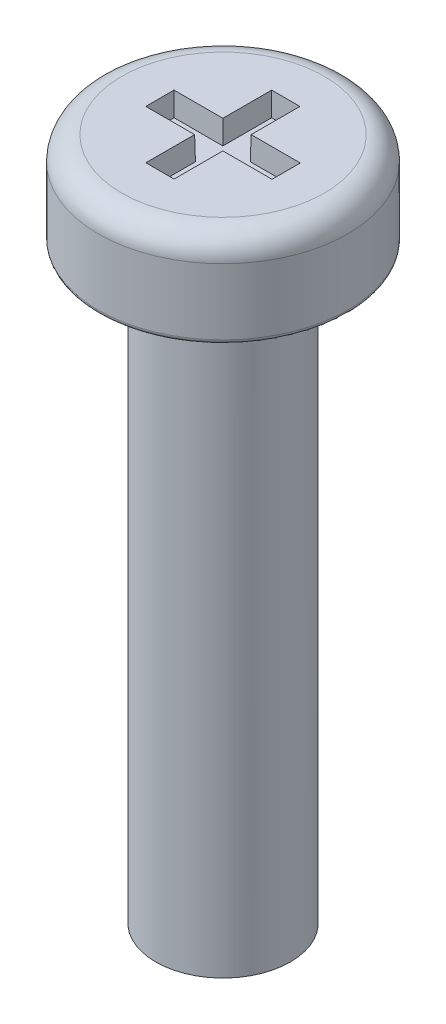
ISO-10303-21;
HEADER;
FILE_DESCRIPTION(('STEP AP214'),'2;1');
FILE_NAME('part.step','',(''),(''),'','','');
FILE_SCHEMA(('AUTOMOTIVE_DESIGN { 1 0 10303 214 1 1 1 1 }'));
ENDSEC;
DATA;
#1=APPLICATION_CONTEXT('core data for automotive mechanical design processes');
#2=APPLICATION_PROTOCOL_DEFINITION('international standard','automotive_design',2000,#1);
#3=PRODUCT_CONTEXT('',#1,'mechanical');
#4=PRODUCT('Part','Part','',(#3));
#5=PRODUCT_RELATED_PRODUCT_CATEGORY('part','',(#4));
#6=PRODUCT_DEFINITION_FORMATION('','',#4);
#7=PRODUCT_DEFINITION_CONTEXT('part definition',#1,'design');
#8=PRODUCT_DEFINITION('design','',#6,#7);
#9=PRODUCT_DEFINITION_SHAPE('','',#8);
#10=(LENGTH_UNIT() NAMED_UNIT(*) SI_UNIT(.MILLI.,.METRE.));
#11=(NAMED_UNIT(*) PLANE_ANGLE_UNIT() SI_UNIT($,.RADIAN.));
#12=(NAMED_UNIT(*) SI_UNIT($,.STERADIAN.) SOLID_ANGLE_UNIT());
#13=UNCERTAINTY_MEASURE_WITH_UNIT(LENGTH_MEASURE(1.E-05),#10,'distance_accuracy_value','');
#14=(GEOMETRIC_REPRESENTATION_CONTEXT(3) GLOBAL_UNCERTAINTY_ASSIGNED_CONTEXT((#13)) GLOBAL_UNIT_ASSIGNED_CONTEXT((#10,
#11,#12)) REPRESENTATION_CONTEXT('',''));
#15=CARTESIAN_POINT('',(0.,0.,0.));
#16=DIRECTION('',(0.,0.,1.));
#17=DIRECTION('',(1.,0.,0.));
#18=AXIS2_PLACEMENT_3D('',#15,#16,#17);
#19=CARTESIAN_POINT('',(0.,2.,0.));
#20=DIRECTION('',(0.,-1.,0.));
#21=DIRECTION('',(0.,0.,-1.));
#22=AXIS2_PLACEMENT_3D('',#19,#20,#21);
#23=CYLINDRICAL_SURFACE('',#22,2.65);
#24=CARTESIAN_POINT('',(0.,0.1,0.));
#25=DIRECTION('',(0.,1.,0.));
#26=DIRECTION('',(0.,0.,1.));
#27=AXIS2_PLACEMENT_3D('',#24,#25,#26);
#28=CIRCLE('',#27,2.65);
#29=CARTESIAN_POINT('',(0.,0.1,2.65));
#30=VERTEX_POINT('',#29);
#31=EDGE_CURVE('E42',#30,#30,#28,.T.);
#32=ORIENTED_EDGE('',*,*,#31,.T.);
#33=EDGE_LOOP('',(#32));
#34=FACE_BOUND('',#33,.T.);
#35=CARTESIAN_POINT('',(0.,1.5,0.));
#36=DIRECTION('',(0.,1.,0.));
#37=DIRECTION('',(0.,0.,1.));
#38=AXIS2_PLACEMENT_3D('',#35,#36,#37);
#39=CIRCLE('',#38,2.65);
#40=CARTESIAN_POINT('',(0.,1.5,2.65));
#41=VERTEX_POINT('',#40);
#42=EDGE_CURVE('E236',#41,#41,#39,.F.);
#43=ORIENTED_EDGE('',*,*,#42,.T.);
#44=EDGE_LOOP('',(#43));
#45=FACE_BOUND('',#44,.T.);
#46=ADVANCED_FACE('F34',(#34,#45),#23,.T.);
#47=CARTESIAN_POINT('',(0.,2.,0.));
#48=DIRECTION('',(0.,1.,0.));
#49=DIRECTION('',(0.,0.,1.));
#50=AXIS2_PLACEMENT_3D('',#47,#48,#49);
#51=PLANE('',#50);
#52=DIRECTION('',(0.,0.,-1.));
#53=VECTOR('',#52,1.);
#54=CARTESIAN_POINT('',(1.34066294059677,2.,0.299999999998247));
#55=LINE('',#54,#53);
#56=CARTESIAN_POINT('',(1.34066294059677,2.,0.299999999998247));
#57=VERTEX_POINT('',#56);
#58=CARTESIAN_POINT('',(1.34066294059677,2.,-0.300000000001753));
#59=VERTEX_POINT('',#58);
#60=EDGE_CURVE('E49',#57,#59,#55,.T.);
#61=ORIENTED_EDGE('',*,*,#60,.F.);
#62=DIRECTION('',(1.,0.,0.));
#63=VECTOR('',#62,1.);
#64=CARTESIAN_POINT('',(0.296573116580834,2.,0.299999999998247));
#65=LINE('',#64,#63);
#66=CARTESIAN_POINT('',(0.296573116580834,2.,0.299999999998247));
#67=VERTEX_POINT('',#66);
#68=EDGE_CURVE('E174',#67,#57,#65,.T.);
#69=ORIENTED_EDGE('',*,*,#68,.F.);
#70=DIRECTION('',(0.,0.,-1.));
#71=VECTOR('',#70,1.);
#72=CARTESIAN_POINT('',(0.296573116580834,2.,1.33613367392197));
#73=LINE('',#72,#71);
#74=CARTESIAN_POINT('',(0.296573116580834,2.,1.33613367392197));
#75=VERTEX_POINT('',#74);
#76=EDGE_CURVE('E172',#75,#67,#73,.T.);
#77=ORIENTED_EDGE('',*,*,#76,.F.);
#78=DIRECTION('',(1.,0.,0.));
#79=VECTOR('',#78,1.);
#80=CARTESIAN_POINT('',(-0.303426883419166,2.,1.33613367392197));
#81=LINE('',#80,#79);
#82=CARTESIAN_POINT('',(-0.303426883419166,2.,1.33613367392197));
#83=VERTEX_POINT('',#82);
#84=EDGE_CURVE('E169',#83,#75,#81,.T.);
#85=ORIENTED_EDGE('',*,*,#84,.F.);
#86=DIRECTION('',(0.,0.,1.));
#87=VECTOR('',#86,1.);
#88=CARTESIAN_POINT('',(-0.303426883419166,2.,1.33613367392197));
#89=LINE('',#88,#87);
#90=CARTESIAN_POINT('',(-0.303426883419166,2.,0.299999999998247));
#91=VERTEX_POINT('',#90);
#92=EDGE_CURVE('E166',#91,#83,#89,.T.);
#93=ORIENTED_EDGE('',*,*,#92,.F.);
#94=DIRECTION('',(1.,0.,0.));
#95=VECTOR('',#94,1.);
#96=CARTESIAN_POINT('',(-1.34066294061243,2.,0.299999999998247));
#97=LINE('',#96,#95);
#98=CARTESIAN_POINT('',(-1.34066294061243,2.,0.299999999998247));
#99=VERTEX_POINT('',#98);
#100=EDGE_CURVE('E163',#99,#91,#97,.T.);
#101=ORIENTED_EDGE('',*,*,#100,.F.);
#102=DIRECTION('',(0.,0.,1.));
#103=VECTOR('',#102,1.);
#104=CARTESIAN_POINT('',(-1.34066294061243,2.,0.299999999998247));
#105=LINE('',#104,#103);
#106=CARTESIAN_POINT('',(-1.34066294061243,2.,-0.300000000001753));
#107=VERTEX_POINT('',#106);
#108=EDGE_CURVE('E160',#107,#99,#105,.T.);
#109=ORIENTED_EDGE('',*,*,#108,.F.);
#110=DIRECTION('',(-1.,0.,0.));
#111=VECTOR('',#110,1.);
#112=CARTESIAN_POINT('',(-1.34066294061243,2.,-0.300000000001753));
#113=LINE('',#112,#111);
#114=CARTESIAN_POINT('',(-0.303426883419166,2.,-0.300000000001753));
#115=VERTEX_POINT('',#114);
#116=EDGE_CURVE('E157',#115,#107,#113,.T.);
#117=ORIENTED_EDGE('',*,*,#116,.F.);
#118=DIRECTION('',(0.,0.,1.));
#119=VECTOR('',#118,1.);
#120=CARTESIAN_POINT('',(-0.303426883419166,2.,-0.300000000001753));
#121=LINE('',#120,#119);
#122=CARTESIAN_POINT('',(-0.303426883419166,2.,-1.3361336739212));
#123=VERTEX_POINT('',#122);
#124=EDGE_CURVE('E151',#123,#115,#121,.T.);
#125=ORIENTED_EDGE('',*,*,#124,.F.);
#126=DIRECTION('',(-1.,0.,0.));
#127=VECTOR('',#126,1.);
#128=CARTESIAN_POINT('',(-0.303426883419166,2.,-1.3361336739212));
#129=LINE('',#128,#127);
#130=CARTESIAN_POINT('',(0.296573116580834,2.,-1.3361336739212));
#131=VERTEX_POINT('',#130);
#132=EDGE_CURVE('E149',#131,#123,#129,.T.);
#133=ORIENTED_EDGE('',*,*,#132,.F.);
#134=DIRECTION('',(0.,0.,-1.));
#135=VECTOR('',#134,1.);
#136=CARTESIAN_POINT('',(0.296573116580834,2.,-0.300000000001753));
#137=LINE('',#136,#135);
#138=CARTESIAN_POINT('',(0.296573116580834,2.,-0.300000000001753));
#139=VERTEX_POINT('',#138);
#140=EDGE_CURVE('E132',#139,#131,#137,.T.);
#141=ORIENTED_EDGE('',*,*,#140,.F.);
#142=DIRECTION('',(-1.,0.,0.));
#143=VECTOR('',#142,1.);
#144=CARTESIAN_POINT('',(0.296573116580834,2.,-0.300000000001753));
#145=LINE('',#144,#143);
#146=EDGE_CURVE('E141',#59,#139,#145,.T.);
#147=ORIENTED_EDGE('',*,*,#146,.F.);
#148=EDGE_LOOP('',(#61,#69,#77,#85,#93,#101,#109,#117,#125,#133,#141,#147));
#149=FACE_BOUND('',#148,.T.);
#150=CARTESIAN_POINT('',(0.,2.,0.));
#151=DIRECTION('',(0.,1.,0.));
#152=DIRECTION('',(0.,0.,1.));
#153=AXIS2_PLACEMENT_3D('',#150,#151,#152);
#154=CIRCLE('',#153,2.15);
#155=CARTESIAN_POINT('',(0.,2.,2.15));
#156=VERTEX_POINT('',#155);
#157=EDGE_CURVE('E233',#156,#156,#154,.T.);
#158=ORIENTED_EDGE('',*,*,#157,.T.);
#159=EDGE_LOOP('',(#158));
#160=FACE_BOUND('',#159,.T.);
#161=ADVANCED_FACE('F145',(#149,#160),#51,.T.);
#162=CARTESIAN_POINT('',(0.,0.,0.));
#163=DIRECTION('',(0.,1.,0.));
#164=DIRECTION('',(0.,0.,1.));
#165=AXIS2_PLACEMENT_3D('',#162,#163,#164);
#166=PLANE('',#165);
#167=CARTESIAN_POINT('',(0.,0.,0.));
#168=DIRECTION('',(0.,1.,0.));
#169=DIRECTION('',(0.,0.,1.));
#170=AXIS2_PLACEMENT_3D('',#167,#168,#169);
#171=CIRCLE('',#170,2.55);
#172=CARTESIAN_POINT('',(0.,0.,2.55));
#173=VERTEX_POINT('',#172);
#174=EDGE_CURVE('E11',#173,#173,#171,.F.);
#175=ORIENTED_EDGE('',*,*,#174,.T.);
#176=EDGE_LOOP('',(#175));
#177=FACE_BOUND('',#176,.T.);
#178=CARTESIAN_POINT('',(0.,0.,0.));
#179=DIRECTION('',(0.,1.,0.));
#180=DIRECTION('',(0.,0.,1.));
#181=AXIS2_PLACEMENT_3D('',#178,#179,#180);
#182=CIRCLE('',#181,1.43);
#183=CARTESIAN_POINT('',(0.,0.,1.43));
#184=VERTEX_POINT('',#183);
#185=EDGE_CURVE('E230',#184,#184,#182,.F.);
#186=ORIENTED_EDGE('',*,*,#185,.F.);
#187=EDGE_LOOP('',(#186));
#188=FACE_BOUND('',#187,.T.);
#189=ADVANCED_FACE('F261',(#177,#188),#166,.F.);
#190=CARTESIAN_POINT('',(0.,-12.5,0.));
#191=DIRECTION('',(0.,1.,0.));
#192=DIRECTION('',(0.,0.,1.));
#193=AXIS2_PLACEMENT_3D('',#190,#191,#192);
#194=CYLINDRICAL_SURFACE('',#193,1.43);
#195=CARTESIAN_POINT('',(0.,-12.5,0.));
#196=DIRECTION('',(0.,-1.,0.));
#197=DIRECTION('',(0.,0.,-1.));
#198=AXIS2_PLACEMENT_3D('',#195,#196,#197);
#199=CIRCLE('',#198,1.43);
#200=CARTESIAN_POINT('',(0.,-12.5,-1.43));
#201=VERTEX_POINT('',#200);
#202=EDGE_CURVE('E178',#201,#201,#199,.T.);
#203=ORIENTED_EDGE('',*,*,#202,.F.);
#204=EDGE_LOOP('',(#203));
#205=FACE_BOUND('',#204,.T.);
#206=ORIENTED_EDGE('',*,*,#185,.T.);
#207=EDGE_LOOP('',(#206));
#208=FACE_BOUND('',#207,.T.);
#209=ADVANCED_FACE('F265',(#205,#208),#194,.T.);
#210=CARTESIAN_POINT('',(0.,-12.5,0.));
#211=DIRECTION('',(0.,-1.,0.));
#212=DIRECTION('',(0.,0.,-1.));
#213=AXIS2_PLACEMENT_3D('',#210,#211,#212);
#214=PLANE('',#213);
#215=ORIENTED_EDGE('',*,*,#202,.T.);
#216=EDGE_LOOP('',(#215));
#217=FACE_BOUND('',#216,.T.);
#218=ADVANCED_FACE('F253',(#217),#214,.T.);
#219=CARTESIAN_POINT('',(0.,1.5,0.));
#220=DIRECTION('',(0.,1.,0.));
#221=DIRECTION('',(0.,0.,1.));
#222=AXIS2_PLACEMENT_3D('',#219,#220,#221);
#223=TOROIDAL_SURFACE('',#222,2.15,0.5);
#224=ORIENTED_EDGE('',*,*,#42,.F.);
#225=EDGE_LOOP('',(#224));
#226=FACE_BOUND('',#225,.T.);
#227=ORIENTED_EDGE('',*,*,#157,.F.);
#228=EDGE_LOOP('',(#227));
#229=FACE_BOUND('',#228,.T.);
#230=ADVANCED_FACE('F245',(#226,#229),#223,.T.);
#231=CARTESIAN_POINT('',(0.,0.1,0.));
#232=DIRECTION('',(0.,1.,0.));
#233=DIRECTION('',(0.,0.,1.));
#234=AXIS2_PLACEMENT_3D('',#231,#232,#233);
#235=TOROIDAL_SURFACE('',#234,2.55,0.1);
#236=ORIENTED_EDGE('',*,*,#174,.F.);
#237=EDGE_LOOP('',(#236));
#238=FACE_BOUND('',#237,.T.);
#239=ORIENTED_EDGE('',*,*,#31,.F.);
#240=EDGE_LOOP('',(#239));
#241=FACE_BOUND('',#240,.T.);
#242=ADVANCED_FACE('F36',(#238,#241),#235,.T.);
#243=CARTESIAN_POINT('',(1.34066294059677,2.,0.299999999998247));
#244=DIRECTION('',(0.999847695156391,-0.0174524064372835,0.));
#245=DIRECTION('',(0.0174524064372835,0.999847695156391,0.));
#246=AXIS2_PLACEMENT_3D('',#243,#244,#245);
#247=PLANE('',#246);
#248=ORIENTED_EDGE('',*,*,#60,.T.);
#249=DIRECTION('',(0.0174497491606827,0.999695459881887,-0.0174497491606827));
#250=VECTOR('',#249,1.);
#251=CARTESIAN_POINT('',(1.34048024434931,1.98953333899279,-0.29981730375429));
#252=LINE('',#251,#250);
#253=CARTESIAN_POINT('',(1.33193540813266,1.5,-0.291272467537644));
#254=VERTEX_POINT('',#253);
#255=EDGE_CURVE('E92',#254,#59,#252,.T.);
#256=ORIENTED_EDGE('',*,*,#255,.F.);
#257=DIRECTION('',(0.,0.,-1.));
#258=VECTOR('',#257,1.);
#259=CARTESIAN_POINT('',(1.33193540813266,1.5,0.299999999998247));
#260=LINE('',#259,#258);
#261=CARTESIAN_POINT('',(1.33193540813266,1.5,0.291272467534139));
#262=VERTEX_POINT('',#261);
#263=EDGE_CURVE('E176',#262,#254,#260,.T.);
#264=ORIENTED_EDGE('',*,*,#263,.F.);
#265=DIRECTION('',(0.0174497491606827,0.999695459881887,0.0174497491606827));
#266=VECTOR('',#265,1.);
#267=CARTESIAN_POINT('',(1.34034502177533,1.98178644291825,0.299682081176812));
#268=LINE('',#267,#266);
#269=EDGE_CURVE('E57',#262,#57,#268,.T.);
#270=ORIENTED_EDGE('',*,*,#269,.T.);
#271=EDGE_LOOP('',(#248,#256,#264,#270));
#272=FACE_BOUND('',#271,.T.);
#273=ADVANCED_FACE('F244',(#272),#247,.F.);
#274=CARTESIAN_POINT('',(0.296573116580834,2.,0.299999999998247));
#275=DIRECTION('',(0.,-0.0174524064372835,0.999847695156391));
#276=DIRECTION('',(0.,-0.999847695156391,-0.0174524064372835));
#277=AXIS2_PLACEMENT_3D('',#274,#275,#276);
#278=PLANE('',#277);
#279=ORIENTED_EDGE('',*,*,#68,.T.);
#280=ORIENTED_EDGE('',*,*,#269,.F.);
#281=DIRECTION('',(1.,0.,0.));
#282=VECTOR('',#281,1.);
#283=CARTESIAN_POINT('',(0.296573116580834,1.5,0.291272467534139));
#284=LINE('',#283,#282);
#285=CARTESIAN_POINT('',(0.287845584116726,1.5,0.291272467534139));
#286=VERTEX_POINT('',#285);
#287=EDGE_CURVE('E179',#286,#262,#284,.T.);
#288=ORIENTED_EDGE('',*,*,#287,.F.);
#289=DIRECTION('',(0.0174497491606827,0.999695459881887,0.0174497491606827));
#290=VECTOR('',#289,1.);
#291=CARTESIAN_POINT('',(0.296573116580834,2.,0.299999999998247));
#292=LINE('',#291,#290);
#293=EDGE_CURVE('E97',#286,#67,#292,.T.);
#294=ORIENTED_EDGE('',*,*,#293,.T.);
#295=EDGE_LOOP('',(#279,#280,#288,#294));
#296=FACE_BOUND('',#295,.T.);
#297=ADVANCED_FACE('F251',(#296),#278,.F.);
#298=CARTESIAN_POINT('',(0.296573116580834,2.,1.33613367392197));
#299=DIRECTION('',(0.999847695156391,-0.0174524064372835,0.));
#300=DIRECTION('',(0.0174524064372835,0.999847695156391,0.));
#301=AXIS2_PLACEMENT_3D('',#298,#299,#300);
#302=PLANE('',#301);
#303=ORIENTED_EDGE('',*,*,#76,.T.);
#304=ORIENTED_EDGE('',*,*,#293,.F.);
#305=DIRECTION('',(0.,0.,-1.));
#306=VECTOR('',#305,1.);
#307=CARTESIAN_POINT('',(0.287845584116726,1.5,1.33613367392197));
#308=LINE('',#307,#306);
#309=CARTESIAN_POINT('',(0.287845584116726,1.5,1.32740614145786));
#310=VERTEX_POINT('',#309);
#311=EDGE_CURVE('E202',#310,#286,#308,.T.);
#312=ORIENTED_EDGE('',*,*,#311,.F.);
#313=DIRECTION('',(0.0174497491606827,0.999695459881887,0.0174497491606827));
#314=VECTOR('',#313,1.);
#315=CARTESIAN_POINT('',(0.296390420333372,1.98953333899279,1.33595097767451));
#316=LINE('',#315,#314);
#317=EDGE_CURVE('E194',#310,#75,#316,.T.);
#318=ORIENTED_EDGE('',*,*,#317,.T.);
#319=EDGE_LOOP('',(#303,#304,#312,#318));
#320=FACE_BOUND('',#319,.T.);
#321=ADVANCED_FACE('F276',(#320),#302,.F.);
#322=CARTESIAN_POINT('',(-0.303426883419166,2.,1.33613367392197));
#323=DIRECTION('',(0.,-0.0174524064372835,0.999847695156391));
#324=DIRECTION('',(0.,-0.999847695156391,-0.0174524064372835));
#325=AXIS2_PLACEMENT_3D('',#322,#323,#324);
#326=PLANE('',#325);
#327=ORIENTED_EDGE('',*,*,#84,.T.);
#328=ORIENTED_EDGE('',*,*,#317,.F.);
#329=DIRECTION('',(1.,0.,0.));
#330=VECTOR('',#329,1.);
#331=CARTESIAN_POINT('',(-0.303426883419166,1.5,1.32740614145786));
#332=LINE('',#331,#330);
#333=CARTESIAN_POINT('',(-0.294699350955057,1.5,1.32740614145786));
#334=VERTEX_POINT('',#333);
#335=EDGE_CURVE('E205',#334,#310,#332,.T.);
#336=ORIENTED_EDGE('',*,*,#335,.F.);
#337=DIRECTION('',(-0.0174497491606827,0.999695459881887,0.0174497491606827));
#338=VECTOR('',#337,1.);
#339=CARTESIAN_POINT('',(-0.303426883419166,2.,1.33613367392197));
#340=LINE('',#339,#338);
#341=EDGE_CURVE('E192',#334,#83,#340,.T.);
#342=ORIENTED_EDGE('',*,*,#341,.T.);
#343=EDGE_LOOP('',(#327,#328,#336,#342));
#344=FACE_BOUND('',#343,.T.);
#345=ADVANCED_FACE('F279',(#344),#326,.F.);
#346=CARTESIAN_POINT('',(-0.303426883419166,2.,1.33613367392197));
#347=DIRECTION('',(-0.999847695156391,-0.0174524064372835,0.));
#348=DIRECTION('',(0.0174524064372835,-0.999847695156391,0.));
#349=AXIS2_PLACEMENT_3D('',#346,#347,#348);
#350=PLANE('',#349);
#351=ORIENTED_EDGE('',*,*,#92,.T.);
#352=ORIENTED_EDGE('',*,*,#341,.F.);
#353=DIRECTION('',(0.,0.,1.));
#354=VECTOR('',#353,1.);
#355=CARTESIAN_POINT('',(-0.294699350955057,1.5,1.33613367392197));
#356=LINE('',#355,#354);
#357=CARTESIAN_POINT('',(-0.294699350955057,1.5,0.291272467534139));
#358=VERTEX_POINT('',#357);
#359=EDGE_CURVE('E208',#358,#334,#356,.T.);
#360=ORIENTED_EDGE('',*,*,#359,.F.);
#361=DIRECTION('',(-0.0174497491606827,0.999695459881887,0.0174497491606827));
#362=VECTOR('',#361,1.);
#363=CARTESIAN_POINT('',(-0.303742379642658,2.01807476653852,0.30031549622174));
#364=LINE('',#363,#362);
#365=EDGE_CURVE('E190',#358,#91,#364,.T.);
#366=ORIENTED_EDGE('',*,*,#365,.T.);
#367=EDGE_LOOP('',(#351,#352,#360,#366));
#368=FACE_BOUND('',#367,.T.);
#369=ADVANCED_FACE('F283',(#368),#350,.F.);
#370=CARTESIAN_POINT('',(-1.34066294061243,2.,0.299999999998247));
#371=DIRECTION('',(0.,-0.0174524064372835,0.999847695156391));
#372=DIRECTION('',(0.,-0.999847695156391,-0.0174524064372835));
#373=AXIS2_PLACEMENT_3D('',#370,#371,#372);
#374=PLANE('',#373);
#375=ORIENTED_EDGE('',*,*,#100,.T.);
#376=ORIENTED_EDGE('',*,*,#365,.F.);
#377=DIRECTION('',(1.,0.,0.));
#378=VECTOR('',#377,1.);
#379=CARTESIAN_POINT('',(-1.34066294061243,1.5,0.291272467534139));
#380=LINE('',#379,#378);
#381=CARTESIAN_POINT('',(-1.33193540814832,1.5,0.291272467534139));
#382=VERTEX_POINT('',#381);
#383=EDGE_CURVE('E211',#382,#358,#380,.T.);
#384=ORIENTED_EDGE('',*,*,#383,.F.);
#385=DIRECTION('',(-0.0174497491606827,0.999695459881887,0.0174497491606827));
#386=VECTOR('',#385,1.);
#387=CARTESIAN_POINT('',(-1.34066294061243,2.,0.299999999998247));
#388=LINE('',#387,#386);
#389=EDGE_CURVE('E188',#382,#99,#388,.T.);
#390=ORIENTED_EDGE('',*,*,#389,.T.);
#391=EDGE_LOOP('',(#375,#376,#384,#390));
#392=FACE_BOUND('',#391,.T.);
#393=ADVANCED_FACE('F287',(#392),#374,.F.);
#394=CARTESIAN_POINT('',(-1.34066294061243,2.,0.299999999998247));
#395=DIRECTION('',(-0.999847695156391,-0.0174524064372835,0.));
#396=DIRECTION('',(0.0174524064372835,-0.999847695156391,0.));
#397=AXIS2_PLACEMENT_3D('',#394,#395,#396);
#398=PLANE('',#397);
#399=ORIENTED_EDGE('',*,*,#108,.T.);
#400=ORIENTED_EDGE('',*,*,#389,.F.);
#401=DIRECTION('',(0.,0.,1.));
#402=VECTOR('',#401,1.);
#403=CARTESIAN_POINT('',(-1.33193540814832,1.5,0.299999999998247));
#404=LINE('',#403,#402);
#405=CARTESIAN_POINT('',(-1.33193540814832,1.5,-0.291272467537644));
#406=VERTEX_POINT('',#405);
#407=EDGE_CURVE('E214',#406,#382,#404,.T.);
#408=ORIENTED_EDGE('',*,*,#407,.F.);
#409=DIRECTION('',(-0.0174497491606827,0.999695459881887,-0.0174497491606827));
#410=VECTOR('',#409,1.);
#411=CARTESIAN_POINT('',(-1.34066294061243,2.,-0.300000000001753));
#412=LINE('',#411,#410);
#413=EDGE_CURVE('E186',#406,#107,#412,.T.);
#414=ORIENTED_EDGE('',*,*,#413,.T.);
#415=EDGE_LOOP('',(#399,#400,#408,#414));
#416=FACE_BOUND('',#415,.T.);
#417=ADVANCED_FACE('F291',(#416),#398,.F.);
#418=CARTESIAN_POINT('',(-1.34066294061243,2.,-0.300000000001753));
#419=DIRECTION('',(0.,-0.0174524064372835,-0.999847695156391));
#420=DIRECTION('',(0.,0.999847695156391,-0.0174524064372835));
#421=AXIS2_PLACEMENT_3D('',#418,#419,#420);
#422=PLANE('',#421);
#423=ORIENTED_EDGE('',*,*,#116,.T.);
#424=ORIENTED_EDGE('',*,*,#413,.F.);
#425=DIRECTION('',(-1.,0.,0.));
#426=VECTOR('',#425,1.);
#427=CARTESIAN_POINT('',(-1.34066294061243,1.5,-0.291272467537644));
#428=LINE('',#427,#426);
#429=CARTESIAN_POINT('',(-0.294699350955057,1.5,-0.291272467537644));
#430=VERTEX_POINT('',#429);
#431=EDGE_CURVE('E217',#430,#406,#428,.T.);
#432=ORIENTED_EDGE('',*,*,#431,.F.);
#433=DIRECTION('',(-0.0174497491606827,0.999695459881887,-0.0174497491606827));
#434=VECTOR('',#433,1.);
#435=CARTESIAN_POINT('',(-0.303742715311469,2.01809399699182,-0.300315831894056));
#436=LINE('',#435,#434);
#437=EDGE_CURVE('E184',#430,#115,#436,.T.);
#438=ORIENTED_EDGE('',*,*,#437,.T.);
#439=EDGE_LOOP('',(#423,#424,#432,#438));
#440=FACE_BOUND('',#439,.T.);
#441=ADVANCED_FACE('F295',(#440),#422,.F.);
#442=CARTESIAN_POINT('',(-0.303426883419166,2.,-0.300000000001753));
#443=DIRECTION('',(-0.999847695156391,-0.0174524064372835,0.));
#444=DIRECTION('',(0.0174524064372835,-0.999847695156391,0.));
#445=AXIS2_PLACEMENT_3D('',#442,#443,#444);
#446=PLANE('',#445);
#447=ORIENTED_EDGE('',*,*,#124,.T.);
#448=ORIENTED_EDGE('',*,*,#437,.F.);
#449=DIRECTION('',(0.,0.,1.));
#450=VECTOR('',#449,1.);
#451=CARTESIAN_POINT('',(-0.294699350955057,1.5,-0.300000000001753));
#452=LINE('',#451,#450);
#453=CARTESIAN_POINT('',(-0.294699350955057,1.5,-1.32740614145709));
#454=VERTEX_POINT('',#453);
#455=EDGE_CURVE('E220',#454,#430,#452,.T.);
#456=ORIENTED_EDGE('',*,*,#455,.F.);
#457=DIRECTION('',(-0.0174497491606827,0.999695459881887,-0.0174497491606827));
#458=VECTOR('',#457,1.);
#459=CARTESIAN_POINT('',(-0.303426883419166,2.,-1.3361336739212));
#460=LINE('',#459,#458);
#461=EDGE_CURVE('E182',#454,#123,#460,.T.);
#462=ORIENTED_EDGE('',*,*,#461,.T.);
#463=EDGE_LOOP('',(#447,#448,#456,#462));
#464=FACE_BOUND('',#463,.T.);
#465=ADVANCED_FACE('F299',(#464),#446,.F.);
#466=CARTESIAN_POINT('',(-0.303426883419166,2.,-1.3361336739212));
#467=DIRECTION('',(0.,-0.0174524064372835,-0.999847695156391));
#468=DIRECTION('',(0.,0.999847695156391,-0.0174524064372835));
#469=AXIS2_PLACEMENT_3D('',#466,#467,#468);
#470=PLANE('',#469);
#471=ORIENTED_EDGE('',*,*,#132,.T.);
#472=ORIENTED_EDGE('',*,*,#461,.F.);
#473=DIRECTION('',(-1.,0.,0.));
#474=VECTOR('',#473,1.);
#475=CARTESIAN_POINT('',(-0.303426883419166,1.5,-1.32740614145709));
#476=LINE('',#475,#474);
#477=CARTESIAN_POINT('',(0.287845584116726,1.5,-1.32740614145709));
#478=VERTEX_POINT('',#477);
#479=EDGE_CURVE('E223',#478,#454,#476,.T.);
#480=ORIENTED_EDGE('',*,*,#479,.F.);
#481=DIRECTION('',(0.0174497491606827,0.999695459881887,-0.0174497491606827));
#482=VECTOR('',#481,1.);
#483=CARTESIAN_POINT('',(0.296257620357343,1.98192523346155,-1.3358181776977));
#484=LINE('',#483,#482);
#485=EDGE_CURVE('E138',#478,#131,#484,.T.);
#486=ORIENTED_EDGE('',*,*,#485,.T.);
#487=EDGE_LOOP('',(#471,#472,#480,#486));
#488=FACE_BOUND('',#487,.T.);
#489=ADVANCED_FACE('F303',(#488),#470,.F.);
#490=CARTESIAN_POINT('',(0.296573116580834,2.,-0.300000000001753));
#491=DIRECTION('',(0.999847695156391,-0.0174524064372835,0.));
#492=DIRECTION('',(0.0174524064372835,0.999847695156391,0.));
#493=AXIS2_PLACEMENT_3D('',#490,#491,#492);
#494=PLANE('',#493);
#495=ORIENTED_EDGE('',*,*,#140,.T.);
#496=ORIENTED_EDGE('',*,*,#485,.F.);
#497=DIRECTION('',(0.,0.,-1.));
#498=VECTOR('',#497,1.);
#499=CARTESIAN_POINT('',(0.287845584116726,1.5,-0.300000000001753));
#500=LINE('',#499,#498);
#501=CARTESIAN_POINT('',(0.287845584116726,1.5,-0.291272467537644));
#502=VERTEX_POINT('',#501);
#503=EDGE_CURVE('E135',#502,#478,#500,.T.);
#504=ORIENTED_EDGE('',*,*,#503,.F.);
#505=DIRECTION('',(0.0174497491606827,0.999695459881887,-0.0174497491606827));
#506=VECTOR('',#505,1.);
#507=CARTESIAN_POINT('',(0.296573116580834,2.,-0.300000000001753));
#508=LINE('',#507,#506);
#509=EDGE_CURVE('E128',#502,#139,#508,.T.);
#510=ORIENTED_EDGE('',*,*,#509,.T.);
#511=EDGE_LOOP('',(#495,#496,#504,#510));
#512=FACE_BOUND('',#511,.T.);
#513=ADVANCED_FACE('F130',(#512),#494,.F.);
#514=CARTESIAN_POINT('',(0.296573116580834,2.,-0.300000000001753));
#515=DIRECTION('',(0.,-0.0174524064372835,-0.999847695156391));
#516=DIRECTION('',(0.,0.999847695156391,-0.0174524064372835));
#517=AXIS2_PLACEMENT_3D('',#514,#515,#516);
#518=PLANE('',#517);
#519=ORIENTED_EDGE('',*,*,#146,.T.);
#520=ORIENTED_EDGE('',*,*,#509,.F.);
#521=DIRECTION('',(-1.,0.,0.));
#522=VECTOR('',#521,1.);
#523=CARTESIAN_POINT('',(0.296573116580834,1.5,-0.291272467537644));
#524=LINE('',#523,#522);
#525=EDGE_CURVE('E199',#254,#502,#524,.T.);
#526=ORIENTED_EDGE('',*,*,#525,.F.);
#527=ORIENTED_EDGE('',*,*,#255,.T.);
#528=EDGE_LOOP('',(#519,#520,#526,#527));
#529=FACE_BOUND('',#528,.T.);
#530=ADVANCED_FACE('F142',(#529),#518,.F.);
#531=CARTESIAN_POINT('',(0.,1.5,0.));
#532=DIRECTION('',(0.,-1.,0.));
#533=DIRECTION('',(0.,0.,-1.));
#534=AXIS2_PLACEMENT_3D('',#531,#532,#533);
#535=PLANE('',#534);
#536=ORIENTED_EDGE('',*,*,#263,.T.);
#537=ORIENTED_EDGE('',*,*,#525,.T.);
#538=ORIENTED_EDGE('',*,*,#503,.T.);
#539=ORIENTED_EDGE('',*,*,#479,.T.);
#540=ORIENTED_EDGE('',*,*,#455,.T.);
#541=ORIENTED_EDGE('',*,*,#431,.T.);
#542=ORIENTED_EDGE('',*,*,#407,.T.);
#543=ORIENTED_EDGE('',*,*,#383,.T.);
#544=ORIENTED_EDGE('',*,*,#359,.T.);
#545=ORIENTED_EDGE('',*,*,#335,.T.);
#546=ORIENTED_EDGE('',*,*,#311,.T.);
#547=ORIENTED_EDGE('',*,*,#287,.T.);
#548=EDGE_LOOP('',(#536,#537,#538,#539,#540,#541,#542,#543,#544,#545,#546,#547));
#549=FACE_BOUND('',#548,.T.);
#550=ADVANCED_FACE('F311',(#549),#535,.F.);
#551=CLOSED_SHELL('',(#46,#161,#189,#209,#218,#230,#242,#273,#297,#321,#345,#369,#393,#417,#441,
#465,#489,#513,#530,#550));
#552=MANIFOLD_SOLID_BREP('B2',#551);
#553=ADVANCED_BREP_SHAPE_REPRESENTATION('',(#18,#552),#14);
#554=SHAPE_DEFINITION_REPRESENTATION(#9,#553);
ENDSEC;
END-ISO-10303-21;
